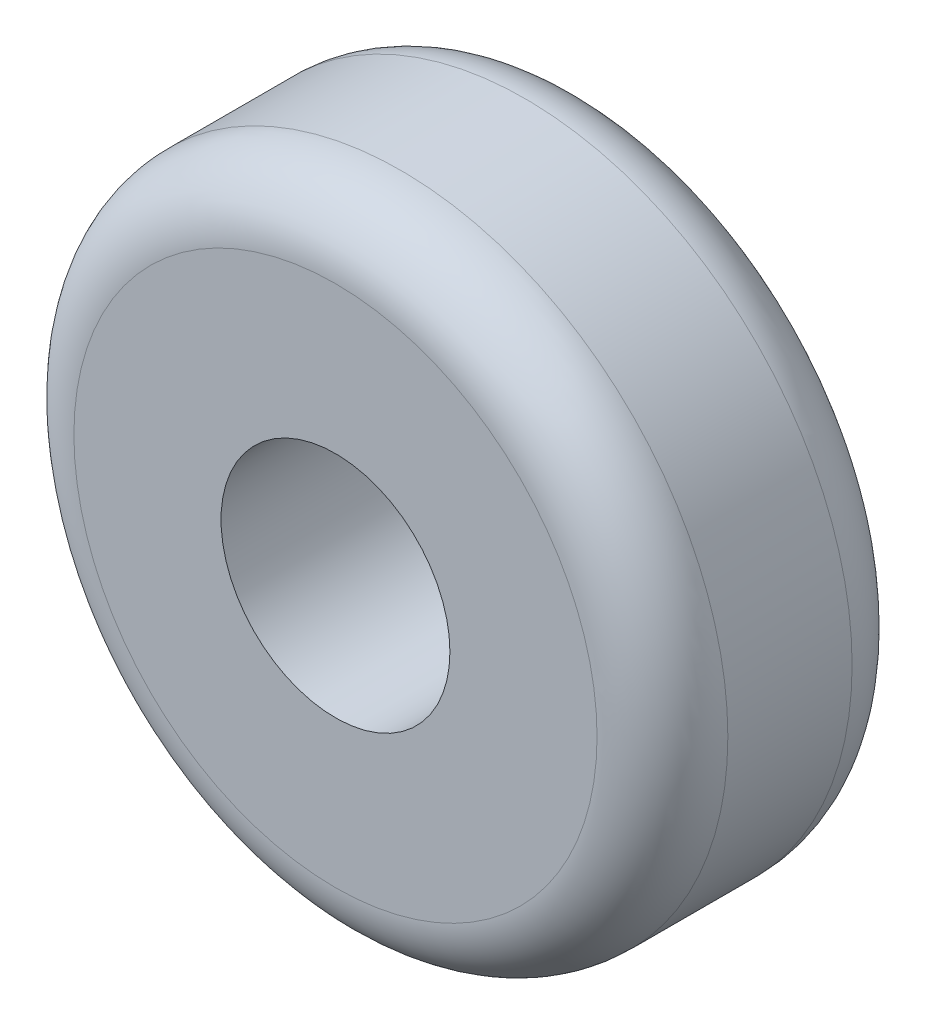
ISO-10303-21;
HEADER;
FILE_DESCRIPTION(('STEP AP214'),'2;1');
FILE_NAME('part.step','',(''),(''),'','','');
FILE_SCHEMA(('AUTOMOTIVE_DESIGN { 1 0 10303 214 1 1 1 1 }'));
ENDSEC;
DATA;
#1=APPLICATION_CONTEXT('core data for automotive mechanical design processes');
#2=APPLICATION_PROTOCOL_DEFINITION('international standard','automotive_design',2000,#1);
#3=PRODUCT_CONTEXT('',#1,'mechanical');
#4=PRODUCT('Part','Part','',(#3));
#5=PRODUCT_RELATED_PRODUCT_CATEGORY('part','',(#4));
#6=PRODUCT_DEFINITION_FORMATION('','',#4);
#7=PRODUCT_DEFINITION_CONTEXT('part definition',#1,'design');
#8=PRODUCT_DEFINITION('design','',#6,#7);
#9=PRODUCT_DEFINITION_SHAPE('','',#8);
#10=(LENGTH_UNIT() NAMED_UNIT(*) SI_UNIT(.MILLI.,.METRE.));
#11=(NAMED_UNIT(*) PLANE_ANGLE_UNIT() SI_UNIT($,.RADIAN.));
#12=(NAMED_UNIT(*) SI_UNIT($,.STERADIAN.) SOLID_ANGLE_UNIT());
#13=UNCERTAINTY_MEASURE_WITH_UNIT(LENGTH_MEASURE(1.E-05),#10,'distance_accuracy_value','');
#14=(GEOMETRIC_REPRESENTATION_CONTEXT(3) GLOBAL_UNCERTAINTY_ASSIGNED_CONTEXT((#13)) GLOBAL_UNIT_ASSIGNED_CONTEXT((#10,
#11,#12)) REPRESENTATION_CONTEXT('',''));
#15=CARTESIAN_POINT('',(0.,0.,0.));
#16=DIRECTION('',(0.,0.,1.));
#17=DIRECTION('',(1.,0.,0.));
#18=AXIS2_PLACEMENT_3D('',#15,#16,#17);
#19=CARTESIAN_POINT('',(0.,0.,39.));
#20=DIRECTION('',(0.,0.,-1.));
#21=DIRECTION('',(-1.,0.,0.));
#22=AXIS2_PLACEMENT_3D('',#19,#20,#21);
#23=CYLINDRICAL_SURFACE('',#22,17.5);
#24=CARTESIAN_POINT('',(0.,0.,39.));
#25=DIRECTION('',(0.,0.,1.));
#26=DIRECTION('',(1.,0.,0.));
#27=AXIS2_PLACEMENT_3D('',#24,#25,#26);
#28=CIRCLE('',#27,17.5);
#29=CARTESIAN_POINT('',(17.5,0.,39.));
#30=VERTEX_POINT('',#29);
#31=EDGE_CURVE('E53',#30,#30,#28,.T.);
#32=ORIENTED_EDGE('',*,*,#31,.T.);
#33=EDGE_LOOP('',(#32));
#34=FACE_BOUND('',#33,.T.);
#35=CARTESIAN_POINT('',(0.,0.,0.));
#36=DIRECTION('',(0.,0.,1.));
#37=DIRECTION('',(1.,0.,0.));
#38=AXIS2_PLACEMENT_3D('',#35,#36,#37);
#39=CIRCLE('',#38,17.5);
#40=CARTESIAN_POINT('',(17.5,0.,0.));
#41=VERTEX_POINT('',#40);
#42=EDGE_CURVE('E54',#41,#41,#39,.T.);
#43=ORIENTED_EDGE('',*,*,#42,.F.);
#44=EDGE_LOOP('',(#43));
#45=FACE_BOUND('',#44,.T.);
#46=ADVANCED_FACE('F33',(#34,#45),#23,.F.);
#47=CARTESIAN_POINT('',(0.,0.,39.));
#48=DIRECTION('',(0.,0.,-1.));
#49=DIRECTION('',(-1.,0.,0.));
#50=AXIS2_PLACEMENT_3D('',#47,#48,#49);
#51=CYLINDRICAL_SURFACE('',#50,50.);
#52=CARTESIAN_POINT('',(0.,0.,10.));
#53=DIRECTION('',(0.,0.,1.));
#54=DIRECTION('',(1.,0.,0.));
#55=AXIS2_PLACEMENT_3D('',#52,#53,#54);
#56=CIRCLE('',#55,50.);
#57=CARTESIAN_POINT('',(50.,0.,10.));
#58=VERTEX_POINT('',#57);
#59=EDGE_CURVE('E44',#58,#58,#56,.T.);
#60=ORIENTED_EDGE('',*,*,#59,.T.);
#61=EDGE_LOOP('',(#60));
#62=FACE_BOUND('',#61,.T.);
#63=CARTESIAN_POINT('',(0.,0.,29.));
#64=DIRECTION('',(0.,0.,1.));
#65=DIRECTION('',(1.,0.,0.));
#66=AXIS2_PLACEMENT_3D('',#63,#64,#65);
#67=CIRCLE('',#66,50.);
#68=CARTESIAN_POINT('',(50.,0.,29.));
#69=VERTEX_POINT('',#68);
#70=EDGE_CURVE('E48',#69,#69,#67,.F.);
#71=ORIENTED_EDGE('',*,*,#70,.T.);
#72=EDGE_LOOP('',(#71));
#73=FACE_BOUND('',#72,.T.);
#74=ADVANCED_FACE('F65',(#62,#73),#51,.T.);
#75=CARTESIAN_POINT('',(0.,0.,39.));
#76=DIRECTION('',(0.,0.,1.));
#77=DIRECTION('',(1.,0.,0.));
#78=AXIS2_PLACEMENT_3D('',#75,#76,#77);
#79=PLANE('',#78);
#80=CARTESIAN_POINT('',(0.,0.,39.));
#81=DIRECTION('',(0.,0.,1.));
#82=DIRECTION('',(1.,0.,0.));
#83=AXIS2_PLACEMENT_3D('',#80,#81,#82);
#84=CIRCLE('',#83,40.);
#85=CARTESIAN_POINT('',(40.,0.,39.));
#86=VERTEX_POINT('',#85);
#87=EDGE_CURVE('E10',#86,#86,#84,.T.);
#88=ORIENTED_EDGE('',*,*,#87,.T.);
#89=EDGE_LOOP('',(#88));
#90=FACE_BOUND('',#89,.T.);
#91=ORIENTED_EDGE('',*,*,#31,.F.);
#92=EDGE_LOOP('',(#91));
#93=FACE_BOUND('',#92,.T.);
#94=ADVANCED_FACE('F62',(#90,#93),#79,.T.);
#95=CARTESIAN_POINT('',(0.,0.,0.));
#96=DIRECTION('',(0.,0.,1.));
#97=DIRECTION('',(1.,0.,0.));
#98=AXIS2_PLACEMENT_3D('',#95,#96,#97);
#99=PLANE('',#98);
#100=CARTESIAN_POINT('',(0.,0.,0.));
#101=DIRECTION('',(0.,0.,1.));
#102=DIRECTION('',(1.,0.,0.));
#103=AXIS2_PLACEMENT_3D('',#100,#101,#102);
#104=CIRCLE('',#103,40.);
#105=CARTESIAN_POINT('',(40.,0.,0.));
#106=VERTEX_POINT('',#105);
#107=EDGE_CURVE('E40',#106,#106,#104,.F.);
#108=ORIENTED_EDGE('',*,*,#107,.T.);
#109=EDGE_LOOP('',(#108));
#110=FACE_BOUND('',#109,.T.);
#111=ORIENTED_EDGE('',*,*,#42,.T.);
#112=EDGE_LOOP('',(#111));
#113=FACE_BOUND('',#112,.T.);
#114=ADVANCED_FACE('F64',(#110,#113),#99,.F.);
#115=CARTESIAN_POINT('',(0.,0.,10.));
#116=DIRECTION('',(0.,0.,1.));
#117=DIRECTION('',(1.,0.,0.));
#118=AXIS2_PLACEMENT_3D('',#115,#116,#117);
#119=TOROIDAL_SURFACE('',#118,40.,10.);
#120=ORIENTED_EDGE('',*,*,#107,.F.);
#121=EDGE_LOOP('',(#120));
#122=FACE_BOUND('',#121,.T.);
#123=ORIENTED_EDGE('',*,*,#59,.F.);
#124=EDGE_LOOP('',(#123));
#125=FACE_BOUND('',#124,.T.);
#126=ADVANCED_FACE('F71',(#122,#125),#119,.T.);
#127=CARTESIAN_POINT('',(0.,0.,29.));
#128=DIRECTION('',(0.,0.,1.));
#129=DIRECTION('',(1.,0.,0.));
#130=AXIS2_PLACEMENT_3D('',#127,#128,#129);
#131=TOROIDAL_SURFACE('',#130,40.,10.);
#132=ORIENTED_EDGE('',*,*,#70,.F.);
#133=EDGE_LOOP('',(#132));
#134=FACE_BOUND('',#133,.T.);
#135=ORIENTED_EDGE('',*,*,#87,.F.);
#136=EDGE_LOOP('',(#135));
#137=FACE_BOUND('',#136,.T.);
#138=ADVANCED_FACE('F35',(#134,#137),#131,.T.);
#139=CLOSED_SHELL('',(#46,#74,#94,#114,#126,#138));
#140=MANIFOLD_SOLID_BREP('B2',#139);
#141=ADVANCED_BREP_SHAPE_REPRESENTATION('',(#18,#140),#14);
#142=SHAPE_DEFINITION_REPRESENTATION(#9,#141);
ENDSEC;
END-ISO-10303-21;
